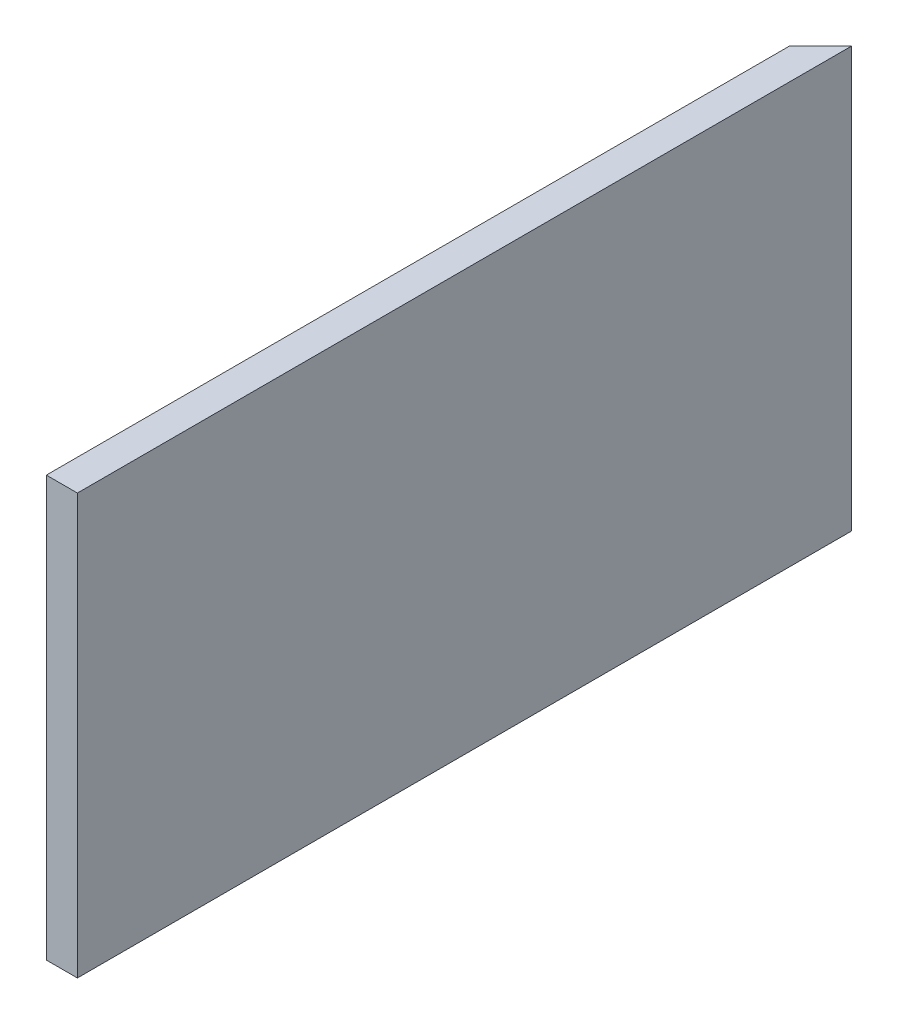
ISO-10303-21;
HEADER;
FILE_DESCRIPTION(('STEP AP214'),'2;1');
FILE_NAME('part.step','',(''),(''),'','','');
FILE_SCHEMA(('AUTOMOTIVE_DESIGN { 1 0 10303 214 1 1 1 1 }'));
ENDSEC;
DATA;
#1=APPLICATION_CONTEXT('core data for automotive mechanical design processes');
#2=APPLICATION_PROTOCOL_DEFINITION('international standard','automotive_design',2000,#1);
#3=PRODUCT_CONTEXT('',#1,'mechanical');
#4=PRODUCT('Part','Part','',(#3));
#5=PRODUCT_RELATED_PRODUCT_CATEGORY('part','',(#4));
#6=PRODUCT_DEFINITION_FORMATION('','',#4);
#7=PRODUCT_DEFINITION_CONTEXT('part definition',#1,'design');
#8=PRODUCT_DEFINITION('design','',#6,#7);
#9=PRODUCT_DEFINITION_SHAPE('','',#8);
#10=(LENGTH_UNIT() NAMED_UNIT(*) SI_UNIT(.MILLI.,.METRE.));
#11=(NAMED_UNIT(*) PLANE_ANGLE_UNIT() SI_UNIT($,.RADIAN.));
#12=(NAMED_UNIT(*) SI_UNIT($,.STERADIAN.) SOLID_ANGLE_UNIT());
#13=UNCERTAINTY_MEASURE_WITH_UNIT(LENGTH_MEASURE(1.E-05),#10,'distance_accuracy_value','');
#14=(GEOMETRIC_REPRESENTATION_CONTEXT(3) GLOBAL_UNCERTAINTY_ASSIGNED_CONTEXT((#13)) GLOBAL_UNIT_ASSIGNED_CONTEXT((#10,
#11,#12)) REPRESENTATION_CONTEXT('',''));
#15=CARTESIAN_POINT('',(0.,0.,0.));
#16=DIRECTION('',(0.,0.,1.));
#17=DIRECTION('',(1.,0.,0.));
#18=AXIS2_PLACEMENT_3D('',#15,#16,#17);
#19=CARTESIAN_POINT('',(303.885599999999,171.7294,-518.097413805219));
#20=DIRECTION('',(-1.,0.,0.));
#21=DIRECTION('',(0.,-1.,0.));
#22=AXIS2_PLACEMENT_3D('',#19,#20,#21);
#23=PLANE('',#22);
#24=DIRECTION('',(0.,1.,0.));
#25=VECTOR('',#24,1.);
#26=CARTESIAN_POINT('',(303.885599999999,171.729399999998,-303.885599999999));
#27=LINE('',#26,#25);
#28=CARTESIAN_POINT('',(303.8856,0.,-303.8856));
#29=VERTEX_POINT('',#28);
#30=CARTESIAN_POINT('',(303.885599999999,171.7294,-303.885599999999));
#31=VERTEX_POINT('',#30);
#32=EDGE_CURVE('E48',#29,#31,#27,.T.);
#33=ORIENTED_EDGE('',*,*,#32,.F.);
#34=DIRECTION('',(0.,0.,1.));
#35=VECTOR('',#34,1.);
#36=CARTESIAN_POINT('',(303.8856,0.,-518.097413805219));
#37=LINE('',#36,#35);
#38=CARTESIAN_POINT('',(303.8856,0.,0.));
#39=VERTEX_POINT('',#38);
#40=EDGE_CURVE('E76',#29,#39,#37,.T.);
#41=ORIENTED_EDGE('',*,*,#40,.T.);
#42=DIRECTION('',(0.,-1.,0.));
#43=VECTOR('',#42,1.);
#44=CARTESIAN_POINT('',(303.885599999999,171.7294,0.));
#45=LINE('',#44,#43);
#46=CARTESIAN_POINT('',(303.885599999999,171.7294,0.));
#47=VERTEX_POINT('',#46);
#48=EDGE_CURVE('E80',#47,#39,#45,.T.);
#49=ORIENTED_EDGE('',*,*,#48,.F.);
#50=DIRECTION('',(0.,0.,1.));
#51=VECTOR('',#50,1.);
#52=CARTESIAN_POINT('',(303.885599999999,171.7294,-518.097413805219));
#53=LINE('',#52,#51);
#54=EDGE_CURVE('E108',#31,#47,#53,.T.);
#55=ORIENTED_EDGE('',*,*,#54,.F.);
#56=EDGE_LOOP('',(#33,#41,#49,#55));
#57=FACE_BOUND('',#56,.T.);
#58=ADVANCED_FACE('F39',(#57),#23,.T.);
#59=CARTESIAN_POINT('',(316.585599999999,171.7294,-518.097413805219));
#60=DIRECTION('',(0.,1.,0.));
#61=DIRECTION('',(0.,0.,1.));
#62=AXIS2_PLACEMENT_3D('',#59,#60,#61);
#63=PLANE('',#62);
#64=DIRECTION('',(0.707106781186548,0.,-0.707106781186548));
#65=VECTOR('',#64,1.);
#66=CARTESIAN_POINT('',(417.341506902609,171.7294,-417.341506902609));
#67=LINE('',#66,#65);
#68=CARTESIAN_POINT('',(316.585599999999,171.7294,-316.585599999999));
#69=VERTEX_POINT('',#68);
#70=EDGE_CURVE('E54',#31,#69,#67,.T.);
#71=ORIENTED_EDGE('',*,*,#70,.F.);
#72=ORIENTED_EDGE('',*,*,#54,.T.);
#73=DIRECTION('',(-1.,0.,0.));
#74=VECTOR('',#73,1.);
#75=CARTESIAN_POINT('',(316.585599999999,171.7294,0.));
#76=LINE('',#75,#74);
#77=CARTESIAN_POINT('',(316.585599999999,171.7294,0.));
#78=VERTEX_POINT('',#77);
#79=EDGE_CURVE('E86',#78,#47,#76,.T.);
#80=ORIENTED_EDGE('',*,*,#79,.F.);
#81=DIRECTION('',(0.,0.,1.));
#82=VECTOR('',#81,1.);
#83=CARTESIAN_POINT('',(316.585599999999,171.7294,-518.097413805219));
#84=LINE('',#83,#82);
#85=EDGE_CURVE('E112',#69,#78,#84,.T.);
#86=ORIENTED_EDGE('',*,*,#85,.F.);
#87=EDGE_LOOP('',(#71,#72,#80,#86));
#88=FACE_BOUND('',#87,.T.);
#89=ADVANCED_FACE('F123',(#88),#63,.T.);
#90=CARTESIAN_POINT('',(316.5856,0.,-518.097413805219));
#91=DIRECTION('',(1.,0.,0.));
#92=DIRECTION('',(0.,1.,0.));
#93=AXIS2_PLACEMENT_3D('',#90,#91,#92);
#94=PLANE('',#93);
#95=DIRECTION('',(0.,-1.,0.));
#96=VECTOR('',#95,1.);
#97=CARTESIAN_POINT('',(316.5856,-1.49817977430545E-12,-316.5856));
#98=LINE('',#97,#96);
#99=CARTESIAN_POINT('',(316.5856,0.,-316.5856));
#100=VERTEX_POINT('',#99);
#101=EDGE_CURVE('E111',#69,#100,#98,.T.);
#102=ORIENTED_EDGE('',*,*,#101,.F.);
#103=ORIENTED_EDGE('',*,*,#85,.T.);
#104=DIRECTION('',(0.,1.,0.));
#105=VECTOR('',#104,1.);
#106=CARTESIAN_POINT('',(316.5856,0.,0.));
#107=LINE('',#106,#105);
#108=CARTESIAN_POINT('',(316.5856,0.,0.));
#109=VERTEX_POINT('',#108);
#110=EDGE_CURVE('E95',#109,#78,#107,.T.);
#111=ORIENTED_EDGE('',*,*,#110,.F.);
#112=DIRECTION('',(0.,0.,1.));
#113=VECTOR('',#112,1.);
#114=CARTESIAN_POINT('',(316.5856,0.,-518.097413805219));
#115=LINE('',#114,#113);
#116=EDGE_CURVE('E85',#100,#109,#115,.T.);
#117=ORIENTED_EDGE('',*,*,#116,.F.);
#118=EDGE_LOOP('',(#102,#103,#111,#117));
#119=FACE_BOUND('',#118,.T.);
#120=ADVANCED_FACE('F125',(#119),#94,.T.);
#121=CARTESIAN_POINT('',(303.8856,0.,-518.097413805219));
#122=DIRECTION('',(0.,-1.,0.));
#123=DIRECTION('',(0.,0.,-1.));
#124=AXIS2_PLACEMENT_3D('',#121,#122,#123);
#125=PLANE('',#124);
#126=DIRECTION('',(-0.707106781186548,0.,0.707106781186548));
#127=VECTOR('',#126,1.);
#128=CARTESIAN_POINT('',(410.991506902609,0.,-410.991506902609));
#129=LINE('',#128,#127);
#130=EDGE_CURVE('E11',#100,#29,#129,.T.);
#131=ORIENTED_EDGE('',*,*,#130,.F.);
#132=ORIENTED_EDGE('',*,*,#116,.T.);
#133=DIRECTION('',(1.,0.,0.));
#134=VECTOR('',#133,1.);
#135=CARTESIAN_POINT('',(303.8856,0.,0.));
#136=LINE('',#135,#134);
#137=EDGE_CURVE('E88',#39,#109,#136,.T.);
#138=ORIENTED_EDGE('',*,*,#137,.F.);
#139=ORIENTED_EDGE('',*,*,#40,.F.);
#140=EDGE_LOOP('',(#131,#132,#138,#139));
#141=FACE_BOUND('',#140,.T.);
#142=ADVANCED_FACE('F89',(#141),#125,.T.);
#143=CARTESIAN_POINT('',(0.,0.,0.));
#144=DIRECTION('',(0.,0.,1.));
#145=DIRECTION('',(1.,0.,0.));
#146=AXIS2_PLACEMENT_3D('',#143,#144,#145);
#147=PLANE('',#146);
#148=ORIENTED_EDGE('',*,*,#48,.T.);
#149=ORIENTED_EDGE('',*,*,#137,.T.);
#150=ORIENTED_EDGE('',*,*,#110,.T.);
#151=ORIENTED_EDGE('',*,*,#79,.T.);
#152=EDGE_LOOP('',(#148,#149,#150,#151));
#153=FACE_BOUND('',#152,.T.);
#154=ADVANCED_FACE('F97',(#153),#147,.T.);
#155=CARTESIAN_POINT('',(0.,0.,0.));
#156=DIRECTION('',(0.707106781186548,0.,0.707106781186548));
#157=DIRECTION('',(0.707106781186548,0.,-0.707106781186548));
#158=AXIS2_PLACEMENT_3D('',#155,#156,#157);
#159=PLANE('',#158);
#160=ORIENTED_EDGE('',*,*,#32,.T.);
#161=ORIENTED_EDGE('',*,*,#70,.T.);
#162=ORIENTED_EDGE('',*,*,#101,.T.);
#163=ORIENTED_EDGE('',*,*,#130,.T.);
#164=EDGE_LOOP('',(#160,#161,#162,#163));
#165=FACE_BOUND('',#164,.T.);
#166=ADVANCED_FACE('F120',(#165),#159,.F.);
#167=CLOSED_SHELL('',(#58,#89,#120,#142,#154,#166));
#168=MANIFOLD_SOLID_BREP('B2',#167);
#169=ADVANCED_BREP_SHAPE_REPRESENTATION('',(#18,#168),#14);
#170=SHAPE_DEFINITION_REPRESENTATION(#9,#169);
ENDSEC;
END-ISO-10303-21;
